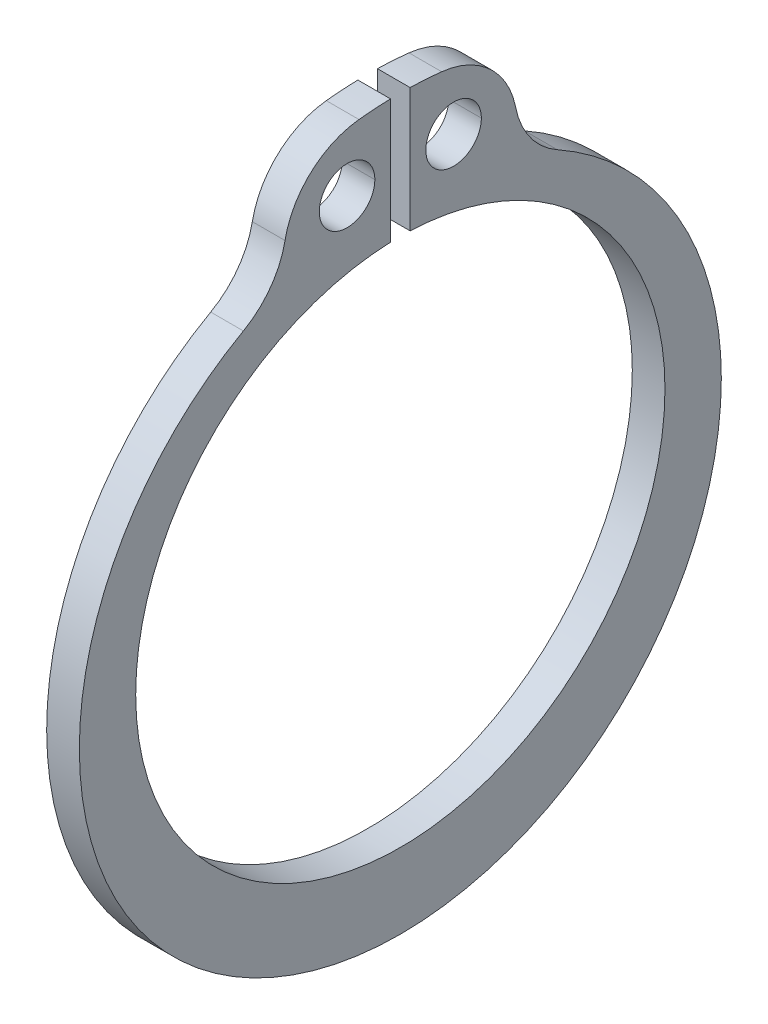
ISO-10303-21;
HEADER;
FILE_DESCRIPTION(('STEP AP214'),'2;1');
FILE_NAME('part.step','',(''),(''),'','','');
FILE_SCHEMA(('AUTOMOTIVE_DESIGN { 1 0 10303 214 1 1 1 1 }'));
ENDSEC;
DATA;
#1=APPLICATION_CONTEXT('core data for automotive mechanical design processes');
#2=APPLICATION_PROTOCOL_DEFINITION('international standard','automotive_design',2000,#1);
#3=PRODUCT_CONTEXT('',#1,'mechanical');
#4=PRODUCT('Part','Part','',(#3));
#5=PRODUCT_RELATED_PRODUCT_CATEGORY('part','',(#4));
#6=PRODUCT_DEFINITION_FORMATION('','',#4);
#7=PRODUCT_DEFINITION_CONTEXT('part definition',#1,'design');
#8=PRODUCT_DEFINITION('design','',#6,#7);
#9=PRODUCT_DEFINITION_SHAPE('','',#8);
#10=(LENGTH_UNIT() NAMED_UNIT(*) SI_UNIT(.MILLI.,.METRE.));
#11=(NAMED_UNIT(*) PLANE_ANGLE_UNIT() SI_UNIT($,.RADIAN.));
#12=(NAMED_UNIT(*) SI_UNIT($,.STERADIAN.) SOLID_ANGLE_UNIT());
#13=UNCERTAINTY_MEASURE_WITH_UNIT(LENGTH_MEASURE(1.E-05),#10,'distance_accuracy_value','');
#14=(GEOMETRIC_REPRESENTATION_CONTEXT(3) GLOBAL_UNCERTAINTY_ASSIGNED_CONTEXT((#13)) GLOBAL_UNIT_ASSIGNED_CONTEXT((#10,
#11,#12)) REPRESENTATION_CONTEXT('',''));
#15=CARTESIAN_POINT('',(0.,0.,0.));
#16=DIRECTION('',(0.,0.,1.));
#17=DIRECTION('',(1.,0.,0.));
#18=AXIS2_PLACEMENT_3D('',#15,#16,#17);
#19=CARTESIAN_POINT('',(1.,9.994442537939,1.63));
#20=DIRECTION('',(1.,0.,0.));
#21=DIRECTION('',(0.,0.,1.));
#22=AXIS2_PLACEMENT_3D('',#19,#20,#21);
#23=CYLINDRICAL_SURFACE('',#22,0.85);
#24=DIRECTION('',(1.,0.,0.));
#25=VECTOR('',#24,1.);
#26=CARTESIAN_POINT('',(0.,9.994442537939,0.78));
#27=LINE('',#26,#25);
#28=CARTESIAN_POINT('',(0.,9.994442537939,0.78));
#29=VERTEX_POINT('',#28);
#30=CARTESIAN_POINT('',(1.,9.994442537939,0.78));
#31=VERTEX_POINT('',#30);
#32=EDGE_CURVE('E11',#29,#31,#27,.T.);
#33=ORIENTED_EDGE('',*,*,#32,.T.);
#34=CARTESIAN_POINT('',(1.,9.994442537939,1.63));
#35=DIRECTION('',(1.,0.,0.));
#36=DIRECTION('',(0.,0.,-1.));
#37=AXIS2_PLACEMENT_3D('',#34,#35,#36);
#38=CIRCLE('',#37,0.85);
#39=CARTESIAN_POINT('',(1.,9.994442537939,2.48));
#40=VERTEX_POINT('',#39);
#41=EDGE_CURVE('E206',#31,#40,#38,.T.);
#42=ORIENTED_EDGE('',*,*,#41,.T.);
#43=DIRECTION('',(1.,0.,0.));
#44=VECTOR('',#43,1.);
#45=CARTESIAN_POINT('',(0.,9.994442537939,2.48));
#46=LINE('',#45,#44);
#47=CARTESIAN_POINT('',(0.,9.994442537939,2.48));
#48=VERTEX_POINT('',#47);
#49=EDGE_CURVE('E27',#48,#40,#46,.T.);
#50=ORIENTED_EDGE('',*,*,#49,.F.);
#51=CARTESIAN_POINT('',(0.,9.994442537939,1.63));
#52=DIRECTION('',(-1.,0.,0.));
#53=DIRECTION('',(0.,0.,1.));
#54=AXIS2_PLACEMENT_3D('',#51,#52,#53);
#55=CIRCLE('',#54,0.85);
#56=EDGE_CURVE('E351',#48,#29,#55,.T.);
#57=ORIENTED_EDGE('',*,*,#56,.T.);
#58=EDGE_LOOP('',(#33,#42,#50,#57));
#59=FACE_BOUND('',#58,.T.);
#60=ADVANCED_FACE('F16',(#59),#23,.F.);
#61=CARTESIAN_POINT('',(1.,9.994442537939,1.63));
#62=DIRECTION('',(1.,0.,0.));
#63=DIRECTION('',(0.,0.,1.));
#64=AXIS2_PLACEMENT_3D('',#61,#62,#63);
#65=CYLINDRICAL_SURFACE('',#64,0.85);
#66=ORIENTED_EDGE('',*,*,#49,.T.);
#67=CARTESIAN_POINT('',(1.,9.994442537939,1.63));
#68=DIRECTION('',(1.,0.,0.));
#69=DIRECTION('',(0.,0.,1.));
#70=AXIS2_PLACEMENT_3D('',#67,#68,#69);
#71=CIRCLE('',#70,0.85);
#72=EDGE_CURVE('E199',#40,#31,#71,.T.);
#73=ORIENTED_EDGE('',*,*,#72,.T.);
#74=ORIENTED_EDGE('',*,*,#32,.F.);
#75=CARTESIAN_POINT('',(0.,9.994442537939,1.63));
#76=DIRECTION('',(-1.,0.,0.));
#77=DIRECTION('',(0.,0.,-1.));
#78=AXIS2_PLACEMENT_3D('',#75,#76,#77);
#79=CIRCLE('',#78,0.85);
#80=EDGE_CURVE('E355',#29,#48,#79,.T.);
#81=ORIENTED_EDGE('',*,*,#80,.T.);
#82=EDGE_LOOP('',(#66,#73,#74,#81));
#83=FACE_BOUND('',#82,.T.);
#84=ADVANCED_FACE('F546',(#83),#65,.F.);
#85=CARTESIAN_POINT('',(1.,9.994442537939,-1.63));
#86=DIRECTION('',(1.,0.,0.));
#87=DIRECTION('',(0.,0.,1.));
#88=AXIS2_PLACEMENT_3D('',#85,#86,#87);
#89=CYLINDRICAL_SURFACE('',#88,0.85);
#90=DIRECTION('',(1.,0.,0.));
#91=VECTOR('',#90,1.);
#92=CARTESIAN_POINT('',(0.,9.994442537939,-2.48));
#93=LINE('',#92,#91);
#94=CARTESIAN_POINT('',(0.,9.994442537939,-2.48));
#95=VERTEX_POINT('',#94);
#96=CARTESIAN_POINT('',(1.,9.994442537939,-2.48));
#97=VERTEX_POINT('',#96);
#98=EDGE_CURVE('E198',#95,#97,#93,.T.);
#99=ORIENTED_EDGE('',*,*,#98,.T.);
#100=CARTESIAN_POINT('',(1.,9.994442537939,-1.63));
#101=DIRECTION('',(1.,0.,0.));
#102=DIRECTION('',(0.,0.,-1.));
#103=AXIS2_PLACEMENT_3D('',#100,#101,#102);
#104=CIRCLE('',#103,0.85);
#105=CARTESIAN_POINT('',(1.,9.994442537939,-0.78));
#106=VERTEX_POINT('',#105);
#107=EDGE_CURVE('E204',#97,#106,#104,.T.);
#108=ORIENTED_EDGE('',*,*,#107,.T.);
#109=DIRECTION('',(1.,0.,0.));
#110=VECTOR('',#109,1.);
#111=CARTESIAN_POINT('',(0.,9.994442537939,-0.78));
#112=LINE('',#111,#110);
#113=CARTESIAN_POINT('',(0.,9.994442537939,-0.78));
#114=VERTEX_POINT('',#113);
#115=EDGE_CURVE('E186',#114,#106,#112,.T.);
#116=ORIENTED_EDGE('',*,*,#115,.F.);
#117=CARTESIAN_POINT('',(0.,9.994442537939,-1.63));
#118=DIRECTION('',(-1.,0.,0.));
#119=DIRECTION('',(0.,0.,1.));
#120=AXIS2_PLACEMENT_3D('',#117,#118,#119);
#121=CIRCLE('',#120,0.85);
#122=EDGE_CURVE('E235',#114,#95,#121,.T.);
#123=ORIENTED_EDGE('',*,*,#122,.T.);
#124=EDGE_LOOP('',(#99,#108,#116,#123));
#125=FACE_BOUND('',#124,.T.);
#126=ADVANCED_FACE('F208',(#125),#89,.F.);
#127=CARTESIAN_POINT('',(1.,9.994442537939,-1.63));
#128=DIRECTION('',(1.,0.,0.));
#129=DIRECTION('',(0.,0.,1.));
#130=AXIS2_PLACEMENT_3D('',#127,#128,#129);
#131=CYLINDRICAL_SURFACE('',#130,0.85);
#132=ORIENTED_EDGE('',*,*,#115,.T.);
#133=CARTESIAN_POINT('',(1.,9.994442537939,-1.63));
#134=DIRECTION('',(1.,0.,0.));
#135=DIRECTION('',(0.,0.,1.));
#136=AXIS2_PLACEMENT_3D('',#133,#134,#135);
#137=CIRCLE('',#136,0.85);
#138=EDGE_CURVE('E189',#106,#97,#137,.T.);
#139=ORIENTED_EDGE('',*,*,#138,.T.);
#140=ORIENTED_EDGE('',*,*,#98,.F.);
#141=CARTESIAN_POINT('',(0.,9.994442537939,-1.63));
#142=DIRECTION('',(-1.,0.,0.));
#143=DIRECTION('',(0.,0.,-1.));
#144=AXIS2_PLACEMENT_3D('',#141,#142,#143);
#145=CIRCLE('',#144,0.85);
#146=EDGE_CURVE('E192',#95,#114,#145,.T.);
#147=ORIENTED_EDGE('',*,*,#146,.T.);
#148=EDGE_LOOP('',(#132,#139,#140,#147));
#149=FACE_BOUND('',#148,.T.);
#150=ADVANCED_FACE('F188',(#149),#131,.F.);
#151=CARTESIAN_POINT('',(1.,0.,0.));
#152=DIRECTION('',(1.,0.,0.));
#153=DIRECTION('',(0.,1.,0.));
#154=AXIS2_PLACEMENT_3D('',#151,#152,#153);
#155=PLANE('',#154);
#156=ORIENTED_EDGE('',*,*,#41,.F.);
#157=ORIENTED_EDGE('',*,*,#72,.F.);
#158=EDGE_LOOP('',(#156,#157));
#159=FACE_BOUND('',#158,.T.);
#160=ORIENTED_EDGE('',*,*,#107,.F.);
#161=ORIENTED_EDGE('',*,*,#138,.F.);
#162=EDGE_LOOP('',(#160,#161));
#163=FACE_BOUND('',#162,.T.);
#164=CARTESIAN_POINT('',(1.,10.25247596521,-6.069260290419));
#165=DIRECTION('',(1.,0.,0.));
#166=DIRECTION('',(0.,-0.192195621664194,0.981356633957867));
#167=AXIS2_PLACEMENT_3D('',#164,#165,#166);
#168=CIRCLE('',#167,2.5875);
#169=CARTESIAN_POINT('',(1.,9.755169794277,-3.530000000029));
#170=VERTEX_POINT('',#169);
#171=CARTESIAN_POINT('',(1.,7.995388830414,-4.804067057765));
#172=VERTEX_POINT('',#171);
#173=EDGE_CURVE('E210',#170,#172,#168,.T.);
#174=ORIENTED_EDGE('',*,*,#173,.F.);
#175=CARTESIAN_POINT('',(1.,9.257863623639,-0.9907397095807));
#176=DIRECTION('',(-1.,0.,0.));
#177=DIRECTION('',(0.,0.994322505385603,-0.1064084361491));
#178=AXIS2_PLACEMENT_3D('',#175,#176,#177);
#179=CIRCLE('',#178,2.5875);
#180=CARTESIAN_POINT('',(1.,11.83067310632,-1.266071538106));
#181=VERTEX_POINT('',#180);
#182=EDGE_CURVE('E231',#181,#170,#179,.T.);
#183=ORIENTED_EDGE('',*,*,#182,.F.);
#184=CARTESIAN_POINT('',(1.,0.,0.));
#185=DIRECTION('',(-1.,0.,0.));
#186=DIRECTION('',(0.,0.999682080487246,-0.0252138444647312));
#187=AXIS2_PLACEMENT_3D('',#184,#185,#186);
#188=CIRCLE('',#187,11.8982252159);
#189=CARTESIAN_POINT('',(1.,11.89444253794,-0.3));
#190=VERTEX_POINT('',#189);
#191=EDGE_CURVE('E314',#190,#181,#188,.T.);
#192=ORIENTED_EDGE('',*,*,#191,.F.);
#193=DIRECTION('',(0.,1.,0.));
#194=VECTOR('',#193,1.);
#195=CARTESIAN_POINT('',(1.,8.094442537939,-0.3));
#196=LINE('',#195,#194);
#197=CARTESIAN_POINT('',(1.,8.094442537939,-0.3));
#198=VERTEX_POINT('',#197);
#199=EDGE_CURVE('E261',#198,#190,#196,.T.);
#200=ORIENTED_EDGE('',*,*,#199,.F.);
#201=CARTESIAN_POINT('',(1.,0.,0.));
#202=DIRECTION('',(1.,0.,0.));
#203=DIRECTION('',(0.,0.,-1.));
#204=AXIS2_PLACEMENT_3D('',#201,#202,#203);
#205=CIRCLE('',#204,8.1);
#206=CARTESIAN_POINT('',(1.,0.,-8.1));
#207=VERTEX_POINT('',#206);
#208=EDGE_CURVE('E298',#207,#198,#205,.T.);
#209=ORIENTED_EDGE('',*,*,#208,.F.);
#210=CARTESIAN_POINT('',(1.,0.,0.));
#211=DIRECTION('',(1.,0.,0.));
#212=DIRECTION('',(0.,0.,1.));
#213=AXIS2_PLACEMENT_3D('',#210,#211,#212);
#214=CIRCLE('',#213,8.1);
#215=CARTESIAN_POINT('',(1.,0.,8.1));
#216=VERTEX_POINT('',#215);
#217=EDGE_CURVE('E296',#216,#207,#214,.T.);
#218=ORIENTED_EDGE('',*,*,#217,.F.);
#219=CARTESIAN_POINT('',(1.,0.,0.));
#220=DIRECTION('',(1.,0.,0.));
#221=DIRECTION('',(0.,0.999313893572744,0.0370370370370416));
#222=AXIS2_PLACEMENT_3D('',#219,#220,#221);
#223=CIRCLE('',#222,8.1);
#224=CARTESIAN_POINT('',(1.,8.094442537939,0.3));
#225=VERTEX_POINT('',#224);
#226=EDGE_CURVE('E293',#225,#216,#223,.T.);
#227=ORIENTED_EDGE('',*,*,#226,.F.);
#228=DIRECTION('',(0.,-1.,0.));
#229=VECTOR('',#228,1.);
#230=CARTESIAN_POINT('',(1.,11.89444253794,0.3));
#231=LINE('',#230,#229);
#232=CARTESIAN_POINT('',(1.,11.89444253794,0.3));
#233=VERTEX_POINT('',#232);
#234=EDGE_CURVE('E227',#233,#225,#231,.T.);
#235=ORIENTED_EDGE('',*,*,#234,.F.);
#236=CARTESIAN_POINT('',(1.,0.,0.));
#237=DIRECTION('',(-1.,0.,0.));
#238=DIRECTION('',(0.,0.994322505386117,0.106408436144302));
#239=AXIS2_PLACEMENT_3D('',#236,#237,#238);
#240=CIRCLE('',#239,11.8982252159);
#241=CARTESIAN_POINT('',(1.,11.83067310632,1.266071538106));
#242=VERTEX_POINT('',#241);
#243=EDGE_CURVE('E228',#242,#233,#240,.T.);
#244=ORIENTED_EDGE('',*,*,#243,.F.);
#245=CARTESIAN_POINT('',(1.,9.257863623639,0.9907397095807));
#246=DIRECTION('',(-1.,0.,0.));
#247=DIRECTION('',(0.,0.192195621644197,0.981356633961783));
#248=AXIS2_PLACEMENT_3D('',#245,#246,#247);
#249=CIRCLE('',#248,2.5875);
#250=CARTESIAN_POINT('',(1.,9.755169794553,3.529999999976));
#251=VERTEX_POINT('',#250);
#252=EDGE_CURVE('E305',#251,#242,#249,.T.);
#253=ORIENTED_EDGE('',*,*,#252,.F.);
#254=CARTESIAN_POINT('',(1.,10.25247596521,6.069260290419));
#255=DIRECTION('',(1.,0.,0.));
#256=DIRECTION('',(0.,-0.872304206685093,-0.488963568171996));
#257=AXIS2_PLACEMENT_3D('',#254,#255,#256);
#258=CIRCLE('',#257,2.5875);
#259=CARTESIAN_POINT('',(1.,7.995388830445,4.804067057705));
#260=VERTEX_POINT('',#259);
#261=EDGE_CURVE('E222',#260,#251,#258,.T.);
#262=ORIENTED_EDGE('',*,*,#261,.F.);
#263=CARTESIAN_POINT('',(1.,-0.575,0.));
#264=DIRECTION('',(-1.,0.,0.));
#265=DIRECTION('',(0.,0.,1.));
#266=AXIS2_PLACEMENT_3D('',#263,#264,#265);
#267=CIRCLE('',#266,9.825);
#268=CARTESIAN_POINT('',(1.,-0.575,9.825));
#269=VERTEX_POINT('',#268);
#270=EDGE_CURVE('E243',#269,#260,#267,.T.);
#271=ORIENTED_EDGE('',*,*,#270,.F.);
#272=CARTESIAN_POINT('',(1.,-0.575,0.));
#273=DIRECTION('',(-1.,0.,0.));
#274=DIRECTION('',(0.,0.,-1.));
#275=AXIS2_PLACEMENT_3D('',#272,#273,#274);
#276=CIRCLE('',#275,9.825);
#277=CARTESIAN_POINT('',(1.,-0.575,-9.825));
#278=VERTEX_POINT('',#277);
#279=EDGE_CURVE('E248',#278,#269,#276,.T.);
#280=ORIENTED_EDGE('',*,*,#279,.F.);
#281=CARTESIAN_POINT('',(1.,-0.575,0.));
#282=DIRECTION('',(-1.,0.,0.));
#283=DIRECTION('',(0.,0.87230420665797,-0.488963568220383));
#284=AXIS2_PLACEMENT_3D('',#281,#282,#283);
#285=CIRCLE('',#284,9.825);
#286=EDGE_CURVE('E256',#172,#278,#285,.T.);
#287=ORIENTED_EDGE('',*,*,#286,.F.);
#288=EDGE_LOOP('',(#174,#183,#192,#200,#209,#218,#227,#235,#244,#253,#262,#271,#280,#287));
#289=FACE_BOUND('',#288,.T.);
#290=ADVANCED_FACE('F202',(#159,#163,#289),#155,.T.);
#291=CARTESIAN_POINT('',(0.,10.25247596521,-6.069260290419));
#292=DIRECTION('',(1.,0.,0.));
#293=DIRECTION('',(0.,0.,1.));
#294=AXIS2_PLACEMENT_3D('',#291,#292,#293);
#295=CYLINDRICAL_SURFACE('',#294,2.5875);
#296=DIRECTION('',(-1.,0.,0.));
#297=VECTOR('',#296,1.);
#298=CARTESIAN_POINT('',(1.,9.755169794277,-3.530000000029));
#299=LINE('',#298,#297);
#300=CARTESIAN_POINT('',(0.,9.755169794154,-3.530000000053));
#301=VERTEX_POINT('',#300);
#302=EDGE_CURVE('E218',#170,#301,#299,.T.);
#303=ORIENTED_EDGE('',*,*,#302,.F.);
#304=ORIENTED_EDGE('',*,*,#173,.T.);
#305=DIRECTION('',(-1.,0.,0.));
#306=VECTOR('',#305,1.);
#307=CARTESIAN_POINT('',(1.,7.995388830447,-4.804067057703));
#308=LINE('',#307,#306);
#309=CARTESIAN_POINT('',(0.,7.995388830414,-4.804067057765));
#310=VERTEX_POINT('',#309);
#311=EDGE_CURVE('E326',#172,#310,#308,.T.);
#312=ORIENTED_EDGE('',*,*,#311,.T.);
#313=CARTESIAN_POINT('',(0.,10.25247596521,-6.069260290419));
#314=DIRECTION('',(-1.,0.,0.));
#315=DIRECTION('',(0.,-0.872304206683474,0.488963568174885));
#316=AXIS2_PLACEMENT_3D('',#313,#314,#315);
#317=CIRCLE('',#316,2.5875);
#318=EDGE_CURVE('E241',#310,#301,#317,.T.);
#319=ORIENTED_EDGE('',*,*,#318,.T.);
#320=EDGE_LOOP('',(#303,#304,#312,#319));
#321=FACE_BOUND('',#320,.T.);
#322=ADVANCED_FACE('F18',(#321),#295,.F.);
#323=CARTESIAN_POINT('',(0.,9.257863623639,-0.9907397095807));
#324=DIRECTION('',(1.,0.,0.));
#325=DIRECTION('',(0.,0.,1.));
#326=AXIS2_PLACEMENT_3D('',#323,#324,#325);
#327=CYLINDRICAL_SURFACE('',#326,2.5875);
#328=DIRECTION('',(-1.,0.,0.));
#329=VECTOR('',#328,1.);
#330=CARTESIAN_POINT('',(1.,11.83067310632,-1.266071538106));
#331=LINE('',#330,#329);
#332=CARTESIAN_POINT('',(0.,11.83067310632,-1.266071538116));
#333=VERTEX_POINT('',#332);
#334=EDGE_CURVE('E317',#181,#333,#331,.T.);
#335=ORIENTED_EDGE('',*,*,#334,.F.);
#336=ORIENTED_EDGE('',*,*,#182,.T.);
#337=ORIENTED_EDGE('',*,*,#302,.T.);
#338=CARTESIAN_POINT('',(0.,9.257863623639,-0.9907397095807));
#339=DIRECTION('',(1.,0.,0.));
#340=DIRECTION('',(0.,0.192195621455007,-0.981356633998835));
#341=AXIS2_PLACEMENT_3D('',#338,#339,#340);
#342=CIRCLE('',#341,2.5875);
#343=EDGE_CURVE('E237',#301,#333,#342,.T.);
#344=ORIENTED_EDGE('',*,*,#343,.T.);
#345=EDGE_LOOP('',(#335,#336,#337,#344));
#346=FACE_BOUND('',#345,.T.);
#347=ADVANCED_FACE('F503',(#346),#327,.T.);
#348=CARTESIAN_POINT('',(0.,0.,0.));
#349=DIRECTION('',(1.,0.,0.));
#350=DIRECTION('',(0.,0.,1.));
#351=AXIS2_PLACEMENT_3D('',#348,#349,#350);
#352=CYLINDRICAL_SURFACE('',#351,11.8982252159);
#353=DIRECTION('',(-1.,0.,0.));
#354=VECTOR('',#353,1.);
#355=CARTESIAN_POINT('',(1.,11.89444253794,-0.3));
#356=LINE('',#355,#354);
#357=CARTESIAN_POINT('',(0.,11.89444253794,-0.3));
#358=VERTEX_POINT('',#357);
#359=EDGE_CURVE('E264',#190,#358,#356,.T.);
#360=ORIENTED_EDGE('',*,*,#359,.F.);
#361=ORIENTED_EDGE('',*,*,#191,.T.);
#362=ORIENTED_EDGE('',*,*,#334,.T.);
#363=CARTESIAN_POINT('',(0.,0.,0.));
#364=DIRECTION('',(1.,0.,0.));
#365=DIRECTION('',(0.,0.994322505386117,-0.106408436144302));
#366=AXIS2_PLACEMENT_3D('',#363,#364,#365);
#367=CIRCLE('',#366,11.8982252159);
#368=EDGE_CURVE('E242',#333,#358,#367,.T.);
#369=ORIENTED_EDGE('',*,*,#368,.T.);
#370=EDGE_LOOP('',(#360,#361,#362,#369));
#371=FACE_BOUND('',#370,.T.);
#372=ADVANCED_FACE('F498',(#371),#352,.T.);
#373=CARTESIAN_POINT('',(0.,11.89444253794,-0.3));
#374=DIRECTION('',(0.,0.,1.));
#375=DIRECTION('',(1.,0.,0.));
#376=AXIS2_PLACEMENT_3D('',#373,#374,#375);
#377=PLANE('',#376);
#378=DIRECTION('',(1.,0.,0.));
#379=VECTOR('',#378,1.);
#380=CARTESIAN_POINT('',(0.,8.094442537939,-0.3));
#381=LINE('',#380,#379);
#382=CARTESIAN_POINT('',(0.,8.094442537939,-0.3));
#383=VERTEX_POINT('',#382);
#384=EDGE_CURVE('E265',#383,#198,#381,.T.);
#385=ORIENTED_EDGE('',*,*,#384,.T.);
#386=ORIENTED_EDGE('',*,*,#199,.T.);
#387=ORIENTED_EDGE('',*,*,#359,.T.);
#388=DIRECTION('',(0.,1.,0.));
#389=VECTOR('',#388,1.);
#390=CARTESIAN_POINT('',(0.,8.094442537939,-0.3));
#391=LINE('',#390,#389);
#392=EDGE_CURVE('E20',#383,#358,#391,.T.);
#393=ORIENTED_EDGE('',*,*,#392,.F.);
#394=EDGE_LOOP('',(#385,#386,#387,#393));
#395=FACE_BOUND('',#394,.T.);
#396=ADVANCED_FACE('F402',(#395),#377,.T.);
#397=CARTESIAN_POINT('',(0.,0.,0.));
#398=DIRECTION('',(1.,0.,0.));
#399=DIRECTION('',(0.,0.,1.));
#400=AXIS2_PLACEMENT_3D('',#397,#398,#399);
#401=CYLINDRICAL_SURFACE('',#400,8.1);
#402=DIRECTION('',(-1.,0.,0.));
#403=VECTOR('',#402,1.);
#404=CARTESIAN_POINT('',(1.,8.094442537939,0.3));
#405=LINE('',#404,#403);
#406=CARTESIAN_POINT('',(0.,8.094442537939,0.3));
#407=VERTEX_POINT('',#406);
#408=EDGE_CURVE('E297',#225,#407,#405,.T.);
#409=ORIENTED_EDGE('',*,*,#408,.F.);
#410=ORIENTED_EDGE('',*,*,#226,.T.);
#411=ORIENTED_EDGE('',*,*,#217,.T.);
#412=ORIENTED_EDGE('',*,*,#208,.T.);
#413=ORIENTED_EDGE('',*,*,#384,.F.);
#414=CARTESIAN_POINT('',(0.,0.,0.));
#415=DIRECTION('',(-1.,0.,0.));
#416=DIRECTION('',(0.,0.999313893572744,-0.0370370370370416));
#417=AXIS2_PLACEMENT_3D('',#414,#415,#416);
#418=CIRCLE('',#417,8.1);
#419=CARTESIAN_POINT('',(0.,0.,-8.1));
#420=VERTEX_POINT('',#419);
#421=EDGE_CURVE('E268',#383,#420,#418,.T.);
#422=ORIENTED_EDGE('',*,*,#421,.T.);
#423=CARTESIAN_POINT('',(0.,0.,0.));
#424=DIRECTION('',(-1.,0.,0.));
#425=DIRECTION('',(0.,0.,-1.));
#426=AXIS2_PLACEMENT_3D('',#423,#424,#425);
#427=CIRCLE('',#426,8.1);
#428=CARTESIAN_POINT('',(0.,-8.094442537939,0.3));
#429=VERTEX_POINT('',#428);
#430=EDGE_CURVE('E266',#420,#429,#427,.T.);
#431=ORIENTED_EDGE('',*,*,#430,.T.);
#432=CARTESIAN_POINT('',(0.,0.,0.));
#433=DIRECTION('',(-1.,0.,0.));
#434=DIRECTION('',(0.,-0.999313893572744,0.0370370370370416));
#435=AXIS2_PLACEMENT_3D('',#432,#433,#434);
#436=CIRCLE('',#435,8.1);
#437=CARTESIAN_POINT('',(0.,0.,8.1));
#438=VERTEX_POINT('',#437);
#439=EDGE_CURVE('E269',#429,#438,#436,.T.);
#440=ORIENTED_EDGE('',*,*,#439,.T.);
#441=CARTESIAN_POINT('',(0.,0.,0.));
#442=DIRECTION('',(-1.,0.,0.));
#443=DIRECTION('',(0.,0.,1.));
#444=AXIS2_PLACEMENT_3D('',#441,#442,#443);
#445=CIRCLE('',#444,8.1);
#446=EDGE_CURVE('E279',#438,#407,#445,.T.);
#447=ORIENTED_EDGE('',*,*,#446,.T.);
#448=EDGE_LOOP('',(#409,#410,#411,#412,#413,#422,#431,#440,#447));
#449=FACE_BOUND('',#448,.T.);
#450=ADVANCED_FACE('F398',(#449),#401,.F.);
#451=CARTESIAN_POINT('',(0.,8.094442537939,0.3));
#452=DIRECTION('',(0.,0.,-1.));
#453=DIRECTION('',(0.,-1.,0.));
#454=AXIS2_PLACEMENT_3D('',#451,#452,#453);
#455=PLANE('',#454);
#456=DIRECTION('',(1.,0.,0.));
#457=VECTOR('',#456,1.);
#458=CARTESIAN_POINT('',(0.,11.89444253794,0.3));
#459=LINE('',#458,#457);
#460=CARTESIAN_POINT('',(0.,11.89444253794,0.3));
#461=VERTEX_POINT('',#460);
#462=EDGE_CURVE('E224',#461,#233,#459,.T.);
#463=ORIENTED_EDGE('',*,*,#462,.T.);
#464=ORIENTED_EDGE('',*,*,#234,.T.);
#465=ORIENTED_EDGE('',*,*,#408,.T.);
#466=DIRECTION('',(0.,-1.,0.));
#467=VECTOR('',#466,1.);
#468=CARTESIAN_POINT('',(0.,11.89444253794,0.3));
#469=LINE('',#468,#467);
#470=EDGE_CURVE('E288',#461,#407,#469,.T.);
#471=ORIENTED_EDGE('',*,*,#470,.F.);
#472=EDGE_LOOP('',(#463,#464,#465,#471));
#473=FACE_BOUND('',#472,.T.);
#474=ADVANCED_FACE('F406',(#473),#455,.T.);
#475=CARTESIAN_POINT('',(0.,0.,0.));
#476=DIRECTION('',(1.,0.,0.));
#477=DIRECTION('',(0.,0.,1.));
#478=AXIS2_PLACEMENT_3D('',#475,#476,#477);
#479=CYLINDRICAL_SURFACE('',#478,11.8982252159);
#480=DIRECTION('',(-1.,0.,0.));
#481=VECTOR('',#480,1.);
#482=CARTESIAN_POINT('',(1.,11.83067310632,1.266071538106));
#483=LINE('',#482,#481);
#484=CARTESIAN_POINT('',(0.,11.83067310632,1.266071538116));
#485=VERTEX_POINT('',#484);
#486=EDGE_CURVE('E252',#242,#485,#483,.T.);
#487=ORIENTED_EDGE('',*,*,#486,.F.);
#488=ORIENTED_EDGE('',*,*,#243,.T.);
#489=ORIENTED_EDGE('',*,*,#462,.F.);
#490=CARTESIAN_POINT('',(0.,0.,0.));
#491=DIRECTION('',(1.,0.,0.));
#492=DIRECTION('',(0.,0.999682080487246,0.0252138444647312));
#493=AXIS2_PLACEMENT_3D('',#490,#491,#492);
#494=CIRCLE('',#493,11.8982252159);
#495=EDGE_CURVE('E313',#461,#485,#494,.T.);
#496=ORIENTED_EDGE('',*,*,#495,.T.);
#497=EDGE_LOOP('',(#487,#488,#489,#496));
#498=FACE_BOUND('',#497,.T.);
#499=ADVANCED_FACE('F375',(#498),#479,.T.);
#500=CARTESIAN_POINT('',(0.,9.257863623639,0.9907397095807));
#501=DIRECTION('',(1.,0.,0.));
#502=DIRECTION('',(0.,0.,1.));
#503=AXIS2_PLACEMENT_3D('',#500,#501,#502);
#504=CYLINDRICAL_SURFACE('',#503,2.5875);
#505=DIRECTION('',(-1.,0.,0.));
#506=VECTOR('',#505,1.);
#507=CARTESIAN_POINT('',(1.,9.755169794553,3.529999999976));
#508=LINE('',#507,#506);
#509=CARTESIAN_POINT('',(0.,9.755169794643,3.529999999957));
#510=VERTEX_POINT('',#509);
#511=EDGE_CURVE('E309',#251,#510,#508,.T.);
#512=ORIENTED_EDGE('',*,*,#511,.F.);
#513=ORIENTED_EDGE('',*,*,#252,.T.);
#514=ORIENTED_EDGE('',*,*,#486,.T.);
#515=CARTESIAN_POINT('',(0.,9.257863623639,0.9907397095807));
#516=DIRECTION('',(1.,0.,0.));
#517=DIRECTION('',(0.,0.994322505385614,0.106408436149001));
#518=AXIS2_PLACEMENT_3D('',#515,#516,#517);
#519=CIRCLE('',#518,2.5875);
#520=EDGE_CURVE('E329',#485,#510,#519,.T.);
#521=ORIENTED_EDGE('',*,*,#520,.T.);
#522=EDGE_LOOP('',(#512,#513,#514,#521));
#523=FACE_BOUND('',#522,.T.);
#524=ADVANCED_FACE('F370',(#523),#504,.T.);
#525=CARTESIAN_POINT('',(0.,10.25247596521,6.069260290419));
#526=DIRECTION('',(1.,0.,0.));
#527=DIRECTION('',(0.,0.,1.));
#528=AXIS2_PLACEMENT_3D('',#525,#526,#527);
#529=CYLINDRICAL_SURFACE('',#528,2.5875);
#530=DIRECTION('',(-1.,0.,0.));
#531=VECTOR('',#530,1.);
#532=CARTESIAN_POINT('',(1.,7.995388830445,4.804067057705));
#533=LINE('',#532,#531);
#534=CARTESIAN_POINT('',(0.,7.99538883041,4.804067057773));
#535=VERTEX_POINT('',#534);
#536=EDGE_CURVE('E247',#260,#535,#533,.T.);
#537=ORIENTED_EDGE('',*,*,#536,.F.);
#538=ORIENTED_EDGE('',*,*,#261,.T.);
#539=ORIENTED_EDGE('',*,*,#511,.T.);
#540=CARTESIAN_POINT('',(0.,10.25247596521,6.069260290419));
#541=DIRECTION('',(-1.,0.,0.));
#542=DIRECTION('',(0.,-0.192195621475003,-0.981356633994919));
#543=AXIS2_PLACEMENT_3D('',#540,#541,#542);
#544=CIRCLE('',#543,2.5875);
#545=EDGE_CURVE('E333',#510,#535,#544,.T.);
#546=ORIENTED_EDGE('',*,*,#545,.T.);
#547=EDGE_LOOP('',(#537,#538,#539,#546));
#548=FACE_BOUND('',#547,.T.);
#549=ADVANCED_FACE('F408',(#548),#529,.F.);
#550=CARTESIAN_POINT('',(0.,-0.575,0.));
#551=DIRECTION('',(1.,0.,0.));
#552=DIRECTION('',(0.,0.,1.));
#553=AXIS2_PLACEMENT_3D('',#550,#551,#552);
#554=CYLINDRICAL_SURFACE('',#553,9.825);
#555=ORIENTED_EDGE('',*,*,#311,.F.);
#556=ORIENTED_EDGE('',*,*,#286,.T.);
#557=ORIENTED_EDGE('',*,*,#279,.T.);
#558=ORIENTED_EDGE('',*,*,#270,.T.);
#559=ORIENTED_EDGE('',*,*,#536,.T.);
#560=CARTESIAN_POINT('',(0.,-0.575,0.));
#561=DIRECTION('',(1.,0.,0.));
#562=DIRECTION('',(0.,0.872304206657509,0.488963568221205));
#563=AXIS2_PLACEMENT_3D('',#560,#561,#562);
#564=CIRCLE('',#563,9.825);
#565=CARTESIAN_POINT('',(0.,-0.575,9.825));
#566=VERTEX_POINT('',#565);
#567=EDGE_CURVE('E232',#535,#566,#564,.T.);
#568=ORIENTED_EDGE('',*,*,#567,.T.);
#569=CARTESIAN_POINT('',(0.,-0.575,0.));
#570=DIRECTION('',(1.,0.,0.));
#571=DIRECTION('',(0.,0.,1.));
#572=AXIS2_PLACEMENT_3D('',#569,#570,#571);
#573=CIRCLE('',#572,9.825);
#574=CARTESIAN_POINT('',(0.,-9.145388830466,-4.804067057673));
#575=VERTEX_POINT('',#574);
#576=EDGE_CURVE('E236',#566,#575,#573,.T.);
#577=ORIENTED_EDGE('',*,*,#576,.T.);
#578=CARTESIAN_POINT('',(0.,-0.575,0.));
#579=DIRECTION('',(1.,0.,0.));
#580=DIRECTION('',(0.,-0.872304206663223,-0.488963568211013));
#581=AXIS2_PLACEMENT_3D('',#578,#579,#580);
#582=CIRCLE('',#581,9.825);
#583=CARTESIAN_POINT('',(0.,-0.575,-9.825));
#584=VERTEX_POINT('',#583);
#585=EDGE_CURVE('E304',#575,#584,#582,.T.);
#586=ORIENTED_EDGE('',*,*,#585,.T.);
#587=CARTESIAN_POINT('',(0.,-0.575,0.));
#588=DIRECTION('',(1.,0.,0.));
#589=DIRECTION('',(0.,0.,-1.));
#590=AXIS2_PLACEMENT_3D('',#587,#588,#589);
#591=CIRCLE('',#590,9.825);
#592=EDGE_CURVE('E260',#584,#310,#591,.T.);
#593=ORIENTED_EDGE('',*,*,#592,.T.);
#594=EDGE_LOOP('',(#555,#556,#557,#558,#559,#568,#577,#586,#593));
#595=FACE_BOUND('',#594,.T.);
#596=ADVANCED_FACE('F564',(#595),#554,.T.);
#597=CARTESIAN_POINT('',(0.,0.,0.));
#598=DIRECTION('',(1.,0.,0.));
#599=DIRECTION('',(0.,1.,0.));
#600=AXIS2_PLACEMENT_3D('',#597,#598,#599);
#601=PLANE('',#600);
#602=ORIENTED_EDGE('',*,*,#56,.F.);
#603=ORIENTED_EDGE('',*,*,#80,.F.);
#604=EDGE_LOOP('',(#602,#603));
#605=FACE_BOUND('',#604,.T.);
#606=ORIENTED_EDGE('',*,*,#122,.F.);
#607=ORIENTED_EDGE('',*,*,#146,.F.);
#608=EDGE_LOOP('',(#606,#607));
#609=FACE_BOUND('',#608,.T.);
#610=ORIENTED_EDGE('',*,*,#545,.F.);
#611=ORIENTED_EDGE('',*,*,#520,.F.);
#612=ORIENTED_EDGE('',*,*,#495,.F.);
#613=ORIENTED_EDGE('',*,*,#470,.T.);
#614=ORIENTED_EDGE('',*,*,#446,.F.);
#615=ORIENTED_EDGE('',*,*,#439,.F.);
#616=ORIENTED_EDGE('',*,*,#430,.F.);
#617=ORIENTED_EDGE('',*,*,#421,.F.);
#618=ORIENTED_EDGE('',*,*,#392,.T.);
#619=ORIENTED_EDGE('',*,*,#368,.F.);
#620=ORIENTED_EDGE('',*,*,#343,.F.);
#621=ORIENTED_EDGE('',*,*,#318,.F.);
#622=ORIENTED_EDGE('',*,*,#592,.F.);
#623=ORIENTED_EDGE('',*,*,#585,.F.);
#624=ORIENTED_EDGE('',*,*,#576,.F.);
#625=ORIENTED_EDGE('',*,*,#567,.F.);
#626=EDGE_LOOP('',(#610,#611,#612,#613,#614,#615,#616,#617,#618,#619,#620,#621,#622,#623,#624,#625));
#627=FACE_BOUND('',#626,.T.);
#628=ADVANCED_FACE('F380',(#605,#609,#627),#601,.F.);
#629=CLOSED_SHELL('',(#60,#84,#126,#150,#290,#322,#347,#372,#396,#450,#474,#499,#524,#549,#596,#628));
#630=MANIFOLD_SOLID_BREP('B1',#629);
#631=ADVANCED_BREP_SHAPE_REPRESENTATION('',(#18,#630),#14);
#632=SHAPE_DEFINITION_REPRESENTATION(#9,#631);
ENDSEC;
END-ISO-10303-21;
